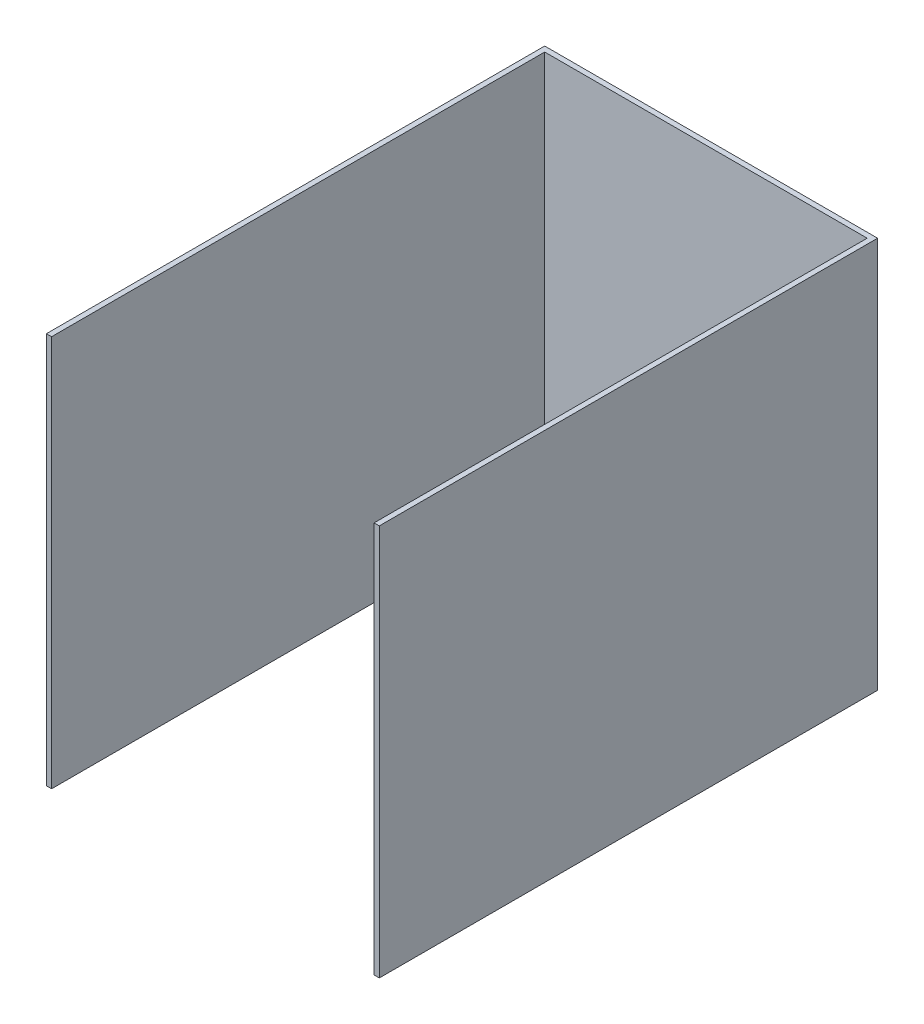
ISO-10303-21;
HEADER;
FILE_DESCRIPTION(('STEP AP214'),'2;1');
FILE_NAME('part.step','',(''),(''),'','','');
FILE_SCHEMA(('AUTOMOTIVE_DESIGN { 1 0 10303 214 1 1 1 1 }'));
ENDSEC;
DATA;
#1=APPLICATION_CONTEXT('core data for automotive mechanical design processes');
#2=APPLICATION_PROTOCOL_DEFINITION('international standard','automotive_design',2000,#1);
#3=PRODUCT_CONTEXT('',#1,'mechanical');
#4=PRODUCT('Part','Part','',(#3));
#5=PRODUCT_RELATED_PRODUCT_CATEGORY('part','',(#4));
#6=PRODUCT_DEFINITION_FORMATION('','',#4);
#7=PRODUCT_DEFINITION_CONTEXT('part definition',#1,'design');
#8=PRODUCT_DEFINITION('design','',#6,#7);
#9=PRODUCT_DEFINITION_SHAPE('','',#8);
#10=(LENGTH_UNIT() NAMED_UNIT(*) SI_UNIT(.MILLI.,.METRE.));
#11=(NAMED_UNIT(*) PLANE_ANGLE_UNIT() SI_UNIT($,.RADIAN.));
#12=(NAMED_UNIT(*) SI_UNIT($,.STERADIAN.) SOLID_ANGLE_UNIT());
#13=UNCERTAINTY_MEASURE_WITH_UNIT(LENGTH_MEASURE(1.E-05),#10,'distance_accuracy_value','');
#14=(GEOMETRIC_REPRESENTATION_CONTEXT(3) GLOBAL_UNCERTAINTY_ASSIGNED_CONTEXT((#13)) GLOBAL_UNIT_ASSIGNED_CONTEXT((#10,
#11,#12)) REPRESENTATION_CONTEXT('',''));
#15=CARTESIAN_POINT('',(0.,0.,0.));
#16=DIRECTION('',(0.,0.,1.));
#17=DIRECTION('',(1.,0.,0.));
#18=AXIS2_PLACEMENT_3D('',#15,#16,#17);
#19=CARTESIAN_POINT('',(0.,0.,3.175));
#20=DIRECTION('',(0.,0.,1.));
#21=DIRECTION('',(1.,0.,0.));
#22=AXIS2_PLACEMENT_3D('',#19,#20,#21);
#23=PLANE('',#22);
#24=DIRECTION('',(1.,0.,0.));
#25=VECTOR('',#24,1.);
#26=CARTESIAN_POINT('',(0.,0.,3.175));
#27=LINE('',#26,#25);
#28=CARTESIAN_POINT('',(-200.025,0.,3.175));
#29=VERTEX_POINT('',#28);
#30=CARTESIAN_POINT('',(-3.17499999999998,0.,3.175));
#31=VERTEX_POINT('',#30);
#32=EDGE_CURVE('E61',#29,#31,#27,.T.);
#33=ORIENTED_EDGE('',*,*,#32,.T.);
#34=DIRECTION('',(0.,-1.,0.));
#35=VECTOR('',#34,1.);
#36=CARTESIAN_POINT('',(-3.17500000000001,239.,3.175));
#37=LINE('',#36,#35);
#38=CARTESIAN_POINT('',(-3.175,239.,3.175));
#39=VERTEX_POINT('',#38);
#40=EDGE_CURVE('E56',#39,#31,#37,.T.);
#41=ORIENTED_EDGE('',*,*,#40,.F.);
#42=DIRECTION('',(-1.,0.,0.));
#43=VECTOR('',#42,1.);
#44=CARTESIAN_POINT('',(0.,239.,3.175));
#45=LINE('',#44,#43);
#46=CARTESIAN_POINT('',(-200.025,239.,3.175));
#47=VERTEX_POINT('',#46);
#48=EDGE_CURVE('E126',#39,#47,#45,.T.);
#49=ORIENTED_EDGE('',*,*,#48,.T.);
#50=DIRECTION('',(0.,1.,0.));
#51=VECTOR('',#50,1.);
#52=CARTESIAN_POINT('',(-200.025,239.,3.175));
#53=LINE('',#52,#51);
#54=EDGE_CURVE('E127',#29,#47,#53,.T.);
#55=ORIENTED_EDGE('',*,*,#54,.F.);
#56=EDGE_LOOP('',(#33,#41,#49,#55));
#57=FACE_BOUND('',#56,.T.);
#58=ADVANCED_FACE('F41',(#57),#23,.T.);
#59=CARTESIAN_POINT('',(0.,0.,3.175));
#60=DIRECTION('',(-1.,0.,0.));
#61=DIRECTION('',(0.,0.,1.));
#62=AXIS2_PLACEMENT_3D('',#59,#60,#61);
#63=PLANE('',#62);
#64=DIRECTION('',(0.,1.,0.));
#65=VECTOR('',#64,1.);
#66=CARTESIAN_POINT('',(0.,0.,0.));
#67=LINE('',#66,#65);
#68=CARTESIAN_POINT('',(0.,0.,0.));
#69=VERTEX_POINT('',#68);
#70=CARTESIAN_POINT('',(0.,239.,0.));
#71=VERTEX_POINT('',#70);
#72=EDGE_CURVE('E149',#69,#71,#67,.T.);
#73=ORIENTED_EDGE('',*,*,#72,.T.);
#74=DIRECTION('',(0.,0.,-1.));
#75=VECTOR('',#74,1.);
#76=CARTESIAN_POINT('',(0.,239.,3.175));
#77=LINE('',#76,#75);
#78=CARTESIAN_POINT('',(0.,239.,304.175));
#79=VERTEX_POINT('',#78);
#80=EDGE_CURVE('E11',#79,#71,#77,.T.);
#81=ORIENTED_EDGE('',*,*,#80,.F.);
#82=DIRECTION('',(0.,1.,0.));
#83=VECTOR('',#82,1.);
#84=CARTESIAN_POINT('',(0.,239.,304.175));
#85=LINE('',#84,#83);
#86=CARTESIAN_POINT('',(0.,0.,304.175));
#87=VERTEX_POINT('',#86);
#88=EDGE_CURVE('E121',#87,#79,#85,.T.);
#89=ORIENTED_EDGE('',*,*,#88,.F.);
#90=DIRECTION('',(0.,0.,-1.));
#91=VECTOR('',#90,1.);
#92=CARTESIAN_POINT('',(0.,0.,3.175));
#93=LINE('',#92,#91);
#94=EDGE_CURVE('E153',#87,#69,#93,.T.);
#95=ORIENTED_EDGE('',*,*,#94,.T.);
#96=EDGE_LOOP('',(#73,#81,#89,#95));
#97=FACE_BOUND('',#96,.T.);
#98=ADVANCED_FACE('F43',(#97),#63,.F.);
#99=CARTESIAN_POINT('',(0.,239.,3.175));
#100=DIRECTION('',(0.,-1.,0.));
#101=DIRECTION('',(1.,0.,0.));
#102=AXIS2_PLACEMENT_3D('',#99,#100,#101);
#103=PLANE('',#102);
#104=DIRECTION('',(-1.,0.,0.));
#105=VECTOR('',#104,1.);
#106=CARTESIAN_POINT('',(0.,239.,0.));
#107=LINE('',#106,#105);
#108=CARTESIAN_POINT('',(-203.2,239.,0.));
#109=VERTEX_POINT('',#108);
#110=EDGE_CURVE('E156',#71,#109,#107,.T.);
#111=ORIENTED_EDGE('',*,*,#110,.T.);
#112=DIRECTION('',(0.,0.,-1.));
#113=VECTOR('',#112,1.);
#114=CARTESIAN_POINT('',(-203.2,239.,3.175));
#115=LINE('',#114,#113);
#116=CARTESIAN_POINT('',(-203.2,239.,304.175));
#117=VERTEX_POINT('',#116);
#118=EDGE_CURVE('E49',#117,#109,#115,.T.);
#119=ORIENTED_EDGE('',*,*,#118,.F.);
#120=DIRECTION('',(-1.,0.,0.));
#121=VECTOR('',#120,1.);
#122=CARTESIAN_POINT('',(-203.2,239.,304.175));
#123=LINE('',#122,#121);
#124=CARTESIAN_POINT('',(-200.025,239.,304.175));
#125=VERTEX_POINT('',#124);
#126=EDGE_CURVE('E141',#125,#117,#123,.T.);
#127=ORIENTED_EDGE('',*,*,#126,.F.);
#128=DIRECTION('',(0.,0.,-1.));
#129=VECTOR('',#128,1.);
#130=CARTESIAN_POINT('',(-200.025,239.,304.175));
#131=LINE('',#130,#129);
#132=EDGE_CURVE('E143',#125,#47,#131,.T.);
#133=ORIENTED_EDGE('',*,*,#132,.T.);
#134=ORIENTED_EDGE('',*,*,#48,.F.);
#135=DIRECTION('',(0.,0.,-1.));
#136=VECTOR('',#135,1.);
#137=CARTESIAN_POINT('',(-3.17500000000001,239.,304.175));
#138=LINE('',#137,#136);
#139=CARTESIAN_POINT('',(-3.17500000000001,239.,304.175));
#140=VERTEX_POINT('',#139);
#141=EDGE_CURVE('E108',#140,#39,#138,.T.);
#142=ORIENTED_EDGE('',*,*,#141,.F.);
#143=DIRECTION('',(-1.,0.,0.));
#144=VECTOR('',#143,1.);
#145=CARTESIAN_POINT('',(-3.17500000000001,239.,304.175));
#146=LINE('',#145,#144);
#147=EDGE_CURVE('E115',#79,#140,#146,.T.);
#148=ORIENTED_EDGE('',*,*,#147,.F.);
#149=ORIENTED_EDGE('',*,*,#80,.T.);
#150=EDGE_LOOP('',(#111,#119,#127,#133,#134,#142,#148,#149));
#151=FACE_BOUND('',#150,.T.);
#152=ADVANCED_FACE('F124',(#151),#103,.F.);
#153=CARTESIAN_POINT('',(-203.2,239.,3.175));
#154=DIRECTION('',(1.,0.,0.));
#155=DIRECTION('',(0.,1.,0.));
#156=AXIS2_PLACEMENT_3D('',#153,#154,#155);
#157=PLANE('',#156);
#158=DIRECTION('',(0.,-1.,0.));
#159=VECTOR('',#158,1.);
#160=CARTESIAN_POINT('',(-203.2,239.,0.));
#161=LINE('',#160,#159);
#162=CARTESIAN_POINT('',(-203.2,0.,0.));
#163=VERTEX_POINT('',#162);
#164=EDGE_CURVE('E158',#109,#163,#161,.T.);
#165=ORIENTED_EDGE('',*,*,#164,.T.);
#166=DIRECTION('',(0.,0.,-1.));
#167=VECTOR('',#166,1.);
#168=CARTESIAN_POINT('',(-203.2,0.,3.175));
#169=LINE('',#168,#167);
#170=CARTESIAN_POINT('',(-203.2,0.,304.175));
#171=VERTEX_POINT('',#170);
#172=EDGE_CURVE('E163',#171,#163,#169,.T.);
#173=ORIENTED_EDGE('',*,*,#172,.F.);
#174=DIRECTION('',(0.,-1.,0.));
#175=VECTOR('',#174,1.);
#176=CARTESIAN_POINT('',(-203.2,239.,304.175));
#177=LINE('',#176,#175);
#178=EDGE_CURVE('E130',#117,#171,#177,.T.);
#179=ORIENTED_EDGE('',*,*,#178,.F.);
#180=ORIENTED_EDGE('',*,*,#118,.T.);
#181=EDGE_LOOP('',(#165,#173,#179,#180));
#182=FACE_BOUND('',#181,.T.);
#183=ADVANCED_FACE('F169',(#182),#157,.F.);
#184=CARTESIAN_POINT('',(0.,0.,3.175));
#185=DIRECTION('',(0.,1.,0.));
#186=DIRECTION('',(-1.,0.,0.));
#187=AXIS2_PLACEMENT_3D('',#184,#185,#186);
#188=PLANE('',#187);
#189=DIRECTION('',(1.,0.,0.));
#190=VECTOR('',#189,1.);
#191=CARTESIAN_POINT('',(0.,0.,0.));
#192=LINE('',#191,#190);
#193=EDGE_CURVE('E151',#163,#69,#192,.T.);
#194=ORIENTED_EDGE('',*,*,#193,.T.);
#195=ORIENTED_EDGE('',*,*,#94,.F.);
#196=DIRECTION('',(1.,0.,0.));
#197=VECTOR('',#196,1.);
#198=CARTESIAN_POINT('',(-3.17499999999998,0.,304.175));
#199=LINE('',#198,#197);
#200=CARTESIAN_POINT('',(-3.17499999999998,0.,304.175));
#201=VERTEX_POINT('',#200);
#202=EDGE_CURVE('E114',#201,#87,#199,.T.);
#203=ORIENTED_EDGE('',*,*,#202,.F.);
#204=DIRECTION('',(0.,0.,-1.));
#205=VECTOR('',#204,1.);
#206=CARTESIAN_POINT('',(-3.17499999999998,0.,304.175));
#207=LINE('',#206,#205);
#208=EDGE_CURVE('E110',#201,#31,#207,.T.);
#209=ORIENTED_EDGE('',*,*,#208,.T.);
#210=ORIENTED_EDGE('',*,*,#32,.F.);
#211=DIRECTION('',(0.,0.,-1.));
#212=VECTOR('',#211,1.);
#213=CARTESIAN_POINT('',(-200.025,0.,304.175));
#214=LINE('',#213,#212);
#215=CARTESIAN_POINT('',(-200.025,0.,304.175));
#216=VERTEX_POINT('',#215);
#217=EDGE_CURVE('E146',#216,#29,#214,.T.);
#218=ORIENTED_EDGE('',*,*,#217,.F.);
#219=DIRECTION('',(1.,0.,0.));
#220=VECTOR('',#219,1.);
#221=CARTESIAN_POINT('',(-203.2,0.,304.175));
#222=LINE('',#221,#220);
#223=EDGE_CURVE('E137',#171,#216,#222,.T.);
#224=ORIENTED_EDGE('',*,*,#223,.F.);
#225=ORIENTED_EDGE('',*,*,#172,.T.);
#226=EDGE_LOOP('',(#194,#195,#203,#209,#210,#218,#224,#225));
#227=FACE_BOUND('',#226,.T.);
#228=ADVANCED_FACE('F176',(#227),#188,.F.);
#229=CARTESIAN_POINT('',(0.,0.,0.));
#230=DIRECTION('',(0.,0.,1.));
#231=DIRECTION('',(1.,0.,0.));
#232=AXIS2_PLACEMENT_3D('',#229,#230,#231);
#233=PLANE('',#232);
#234=ORIENTED_EDGE('',*,*,#72,.F.);
#235=ORIENTED_EDGE('',*,*,#193,.F.);
#236=ORIENTED_EDGE('',*,*,#164,.F.);
#237=ORIENTED_EDGE('',*,*,#110,.F.);
#238=EDGE_LOOP('',(#234,#235,#236,#237));
#239=FACE_BOUND('',#238,.T.);
#240=ADVANCED_FACE('F174',(#239),#233,.F.);
#241=CARTESIAN_POINT('',(-200.025,239.,304.175));
#242=DIRECTION('',(-1.,0.,0.));
#243=DIRECTION('',(0.,-1.,0.));
#244=AXIS2_PLACEMENT_3D('',#241,#242,#243);
#245=PLANE('',#244);
#246=ORIENTED_EDGE('',*,*,#54,.T.);
#247=ORIENTED_EDGE('',*,*,#132,.F.);
#248=DIRECTION('',(0.,1.,0.));
#249=VECTOR('',#248,1.);
#250=CARTESIAN_POINT('',(-200.025,239.,304.175));
#251=LINE('',#250,#249);
#252=EDGE_CURVE('E139',#216,#125,#251,.T.);
#253=ORIENTED_EDGE('',*,*,#252,.F.);
#254=ORIENTED_EDGE('',*,*,#217,.T.);
#255=EDGE_LOOP('',(#246,#247,#253,#254));
#256=FACE_BOUND('',#255,.T.);
#257=ADVANCED_FACE('F184',(#256),#245,.F.);
#258=CARTESIAN_POINT('',(0.,0.,304.175));
#259=DIRECTION('',(0.,0.,1.));
#260=DIRECTION('',(1.,0.,0.));
#261=AXIS2_PLACEMENT_3D('',#258,#259,#260);
#262=PLANE('',#261);
#263=ORIENTED_EDGE('',*,*,#178,.T.);
#264=ORIENTED_EDGE('',*,*,#223,.T.);
#265=ORIENTED_EDGE('',*,*,#252,.T.);
#266=ORIENTED_EDGE('',*,*,#126,.T.);
#267=EDGE_LOOP('',(#263,#264,#265,#266));
#268=FACE_BOUND('',#267,.T.);
#269=ADVANCED_FACE('F187',(#268),#262,.T.);
#270=CARTESIAN_POINT('',(-3.17500000000001,239.,304.175));
#271=DIRECTION('',(1.,0.,0.));
#272=DIRECTION('',(0.,1.,0.));
#273=AXIS2_PLACEMENT_3D('',#270,#271,#272);
#274=PLANE('',#273);
#275=ORIENTED_EDGE('',*,*,#40,.T.);
#276=ORIENTED_EDGE('',*,*,#208,.F.);
#277=DIRECTION('',(0.,-1.,0.));
#278=VECTOR('',#277,1.);
#279=CARTESIAN_POINT('',(-3.17500000000001,239.,304.175));
#280=LINE('',#279,#278);
#281=EDGE_CURVE('E104',#140,#201,#280,.T.);
#282=ORIENTED_EDGE('',*,*,#281,.F.);
#283=ORIENTED_EDGE('',*,*,#141,.T.);
#284=EDGE_LOOP('',(#275,#276,#282,#283));
#285=FACE_BOUND('',#284,.T.);
#286=ADVANCED_FACE('F106',(#285),#274,.F.);
#287=CARTESIAN_POINT('',(0.,0.,304.175));
#288=DIRECTION('',(0.,0.,-1.));
#289=DIRECTION('',(-1.,0.,0.));
#290=AXIS2_PLACEMENT_3D('',#287,#288,#289);
#291=PLANE('',#290);
#292=ORIENTED_EDGE('',*,*,#147,.T.);
#293=ORIENTED_EDGE('',*,*,#281,.T.);
#294=ORIENTED_EDGE('',*,*,#202,.T.);
#295=ORIENTED_EDGE('',*,*,#88,.T.);
#296=EDGE_LOOP('',(#292,#293,#294,#295));
#297=FACE_BOUND('',#296,.T.);
#298=ADVANCED_FACE('F119',(#297),#291,.F.);
#299=CLOSED_SHELL('',(#58,#98,#152,#183,#228,#240,#257,#269,#286,#298));
#300=MANIFOLD_SOLID_BREP('B2',#299);
#301=ADVANCED_BREP_SHAPE_REPRESENTATION('',(#18,#300),#14);
#302=SHAPE_DEFINITION_REPRESENTATION(#9,#301);
ENDSEC;
END-ISO-10303-21;
